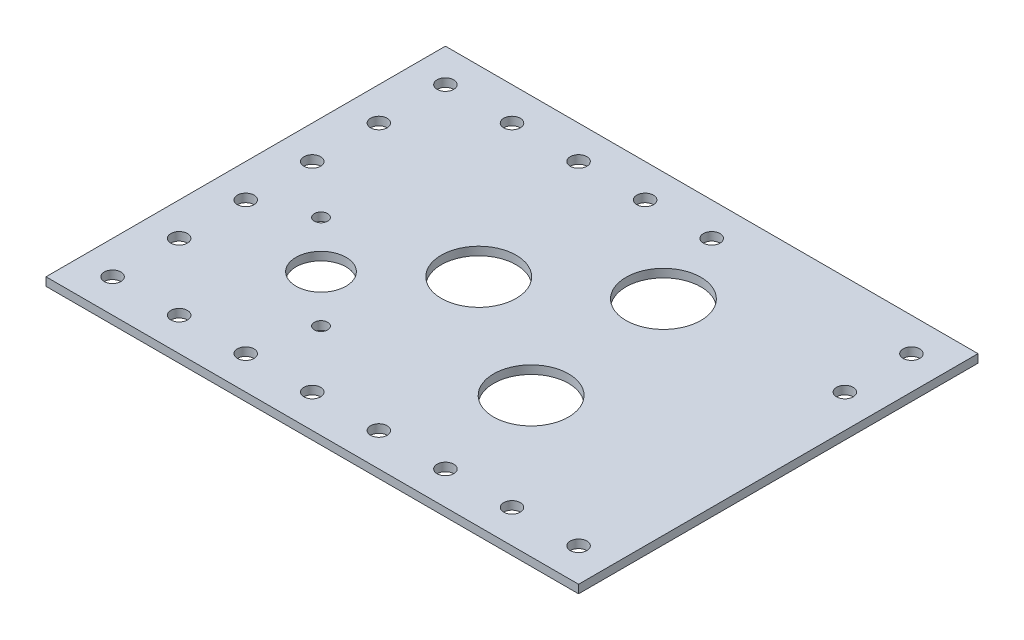
ISO-10303-21;
HEADER;
FILE_DESCRIPTION(('STEP AP214'),'2;1');
FILE_NAME('part.step','',(''),(''),'','','');
FILE_SCHEMA(('AUTOMOTIVE_DESIGN { 1 0 10303 214 1 1 1 1 }'));
ENDSEC;
DATA;
#1=APPLICATION_CONTEXT('core data for automotive mechanical design processes');
#2=APPLICATION_PROTOCOL_DEFINITION('international standard','automotive_design',2000,#1);
#3=PRODUCT_CONTEXT('',#1,'mechanical');
#4=PRODUCT('Part','Part','',(#3));
#5=PRODUCT_RELATED_PRODUCT_CATEGORY('part','',(#4));
#6=PRODUCT_DEFINITION_FORMATION('','',#4);
#7=PRODUCT_DEFINITION_CONTEXT('part definition',#1,'design');
#8=PRODUCT_DEFINITION('design','',#6,#7);
#9=PRODUCT_DEFINITION_SHAPE('','',#8);
#10=(LENGTH_UNIT() NAMED_UNIT(*) SI_UNIT(.MILLI.,.METRE.));
#11=(NAMED_UNIT(*) PLANE_ANGLE_UNIT() SI_UNIT($,.RADIAN.));
#12=(NAMED_UNIT(*) SI_UNIT($,.STERADIAN.) SOLID_ANGLE_UNIT());
#13=UNCERTAINTY_MEASURE_WITH_UNIT(LENGTH_MEASURE(1.E-05),#10,'distance_accuracy_value','');
#14=(GEOMETRIC_REPRESENTATION_CONTEXT(3) GLOBAL_UNCERTAINTY_ASSIGNED_CONTEXT((#13)) GLOBAL_UNIT_ASSIGNED_CONTEXT((#10,
#11,#12)) REPRESENTATION_CONTEXT('',''));
#15=CARTESIAN_POINT('',(0.,0.,0.));
#16=DIRECTION('',(0.,0.,1.));
#17=DIRECTION('',(1.,0.,0.));
#18=AXIS2_PLACEMENT_3D('',#15,#16,#17);
#19=CARTESIAN_POINT('',(0.,3.175,0.));
#20=DIRECTION('',(1.,0.,0.));
#21=DIRECTION('',(0.,0.,-1.));
#22=AXIS2_PLACEMENT_3D('',#19,#20,#21);
#23=PLANE('',#22);
#24=DIRECTION('',(0.,0.,1.));
#25=VECTOR('',#24,1.);
#26=CARTESIAN_POINT('',(0.,0.,0.));
#27=LINE('',#26,#25);
#28=CARTESIAN_POINT('',(0.,0.,-152.4));
#29=VERTEX_POINT('',#28);
#30=CARTESIAN_POINT('',(0.,0.,0.));
#31=VERTEX_POINT('',#30);
#32=EDGE_CURVE('E103',#29,#31,#27,.T.);
#33=ORIENTED_EDGE('',*,*,#32,.T.);
#34=DIRECTION('',(0.,-1.,0.));
#35=VECTOR('',#34,1.);
#36=CARTESIAN_POINT('',(0.,3.175,0.));
#37=LINE('',#36,#35);
#38=CARTESIAN_POINT('',(0.,3.175,0.));
#39=VERTEX_POINT('',#38);
#40=EDGE_CURVE('E11',#39,#31,#37,.T.);
#41=ORIENTED_EDGE('',*,*,#40,.F.);
#42=DIRECTION('',(0.,0.,1.));
#43=VECTOR('',#42,1.);
#44=CARTESIAN_POINT('',(0.,3.175,0.));
#45=LINE('',#44,#43);
#46=CARTESIAN_POINT('',(0.,3.175,-152.4));
#47=VERTEX_POINT('',#46);
#48=EDGE_CURVE('E90',#47,#39,#45,.T.);
#49=ORIENTED_EDGE('',*,*,#48,.F.);
#50=DIRECTION('',(0.,-1.,0.));
#51=VECTOR('',#50,1.);
#52=CARTESIAN_POINT('',(0.,3.175,-152.4));
#53=LINE('',#52,#51);
#54=EDGE_CURVE('E99',#47,#29,#53,.T.);
#55=ORIENTED_EDGE('',*,*,#54,.T.);
#56=EDGE_LOOP('',(#33,#41,#49,#55));
#57=FACE_BOUND('',#56,.T.);
#58=ADVANCED_FACE('F37',(#57),#23,.F.);
#59=CARTESIAN_POINT('',(0.,3.175,0.));
#60=DIRECTION('',(0.,0.,-1.));
#61=DIRECTION('',(-1.,0.,0.));
#62=AXIS2_PLACEMENT_3D('',#59,#60,#61);
#63=PLANE('',#62);
#64=DIRECTION('',(1.,0.,0.));
#65=VECTOR('',#64,1.);
#66=CARTESIAN_POINT('',(0.,0.,0.));
#67=LINE('',#66,#65);
#68=CARTESIAN_POINT('',(203.2,0.,0.));
#69=VERTEX_POINT('',#68);
#70=EDGE_CURVE('E94',#31,#69,#67,.T.);
#71=ORIENTED_EDGE('',*,*,#70,.T.);
#72=DIRECTION('',(0.,-1.,0.));
#73=VECTOR('',#72,1.);
#74=CARTESIAN_POINT('',(203.2,3.175,0.));
#75=LINE('',#74,#73);
#76=CARTESIAN_POINT('',(203.2,3.175,0.));
#77=VERTEX_POINT('',#76);
#78=EDGE_CURVE('E46',#77,#69,#75,.T.);
#79=ORIENTED_EDGE('',*,*,#78,.F.);
#80=DIRECTION('',(1.,0.,0.));
#81=VECTOR('',#80,1.);
#82=CARTESIAN_POINT('',(0.,3.175,0.));
#83=LINE('',#82,#81);
#84=EDGE_CURVE('E85',#39,#77,#83,.T.);
#85=ORIENTED_EDGE('',*,*,#84,.F.);
#86=ORIENTED_EDGE('',*,*,#40,.T.);
#87=EDGE_LOOP('',(#71,#79,#85,#86));
#88=FACE_BOUND('',#87,.T.);
#89=ADVANCED_FACE('F93',(#88),#63,.F.);
#90=CARTESIAN_POINT('',(203.2,3.175,0.));
#91=DIRECTION('',(-1.,0.,0.));
#92=DIRECTION('',(0.,0.,1.));
#93=AXIS2_PLACEMENT_3D('',#90,#91,#92);
#94=PLANE('',#93);
#95=DIRECTION('',(0.,0.,-1.));
#96=VECTOR('',#95,1.);
#97=CARTESIAN_POINT('',(203.2,0.,0.));
#98=LINE('',#97,#96);
#99=CARTESIAN_POINT('',(203.2,0.,-152.4));
#100=VERTEX_POINT('',#99);
#101=EDGE_CURVE('E72',#69,#100,#98,.T.);
#102=ORIENTED_EDGE('',*,*,#101,.T.);
#103=DIRECTION('',(0.,-1.,0.));
#104=VECTOR('',#103,1.);
#105=CARTESIAN_POINT('',(203.2,3.175,-152.4));
#106=LINE('',#105,#104);
#107=CARTESIAN_POINT('',(203.2,3.175,-152.4));
#108=VERTEX_POINT('',#107);
#109=EDGE_CURVE('E95',#108,#100,#106,.T.);
#110=ORIENTED_EDGE('',*,*,#109,.F.);
#111=DIRECTION('',(0.,0.,-1.));
#112=VECTOR('',#111,1.);
#113=CARTESIAN_POINT('',(203.2,3.175,0.));
#114=LINE('',#113,#112);
#115=EDGE_CURVE('E88',#77,#108,#114,.T.);
#116=ORIENTED_EDGE('',*,*,#115,.F.);
#117=ORIENTED_EDGE('',*,*,#78,.T.);
#118=EDGE_LOOP('',(#102,#110,#116,#117));
#119=FACE_BOUND('',#118,.T.);
#120=ADVANCED_FACE('F97',(#119),#94,.F.);
#121=CARTESIAN_POINT('',(0.,3.175,-152.4));
#122=DIRECTION('',(0.,0.,1.));
#123=DIRECTION('',(1.,0.,0.));
#124=AXIS2_PLACEMENT_3D('',#121,#122,#123);
#125=PLANE('',#124);
#126=DIRECTION('',(-1.,0.,0.));
#127=VECTOR('',#126,1.);
#128=CARTESIAN_POINT('',(0.,0.,-152.4));
#129=LINE('',#128,#127);
#130=EDGE_CURVE('E78',#100,#29,#129,.T.);
#131=ORIENTED_EDGE('',*,*,#130,.T.);
#132=ORIENTED_EDGE('',*,*,#54,.F.);
#133=DIRECTION('',(-1.,0.,0.));
#134=VECTOR('',#133,1.);
#135=CARTESIAN_POINT('',(0.,3.175,-152.4));
#136=LINE('',#135,#134);
#137=EDGE_CURVE('E55',#108,#47,#136,.T.);
#138=ORIENTED_EDGE('',*,*,#137,.F.);
#139=ORIENTED_EDGE('',*,*,#109,.T.);
#140=EDGE_LOOP('',(#131,#132,#138,#139));
#141=FACE_BOUND('',#140,.T.);
#142=ADVANCED_FACE('F266',(#141),#125,.F.);
#143=CARTESIAN_POINT('',(0.,3.175,0.));
#144=DIRECTION('',(0.,-1.,0.));
#145=DIRECTION('',(0.,0.,-1.));
#146=AXIS2_PLACEMENT_3D('',#143,#144,#145);
#147=PLANE('',#146);
#148=CARTESIAN_POINT('',(131.7498,3.175,-53.34));
#149=DIRECTION('',(0.,1.,0.));
#150=DIRECTION('',(0.,0.,1.));
#151=AXIS2_PLACEMENT_3D('',#148,#149,#150);
#152=CIRCLE('',#151,14.2875);
#153=CARTESIAN_POINT('',(131.7498,3.175,-39.0525));
#154=VERTEX_POINT('',#153);
#155=EDGE_CURVE('E214',#154,#154,#152,.T.);
#156=ORIENTED_EDGE('',*,*,#155,.F.);
#157=EDGE_LOOP('',(#156));
#158=FACE_BOUND('',#157,.T.);
#159=CARTESIAN_POINT('',(125.095,3.175,-110.49));
#160=DIRECTION('',(0.,1.,0.));
#161=DIRECTION('',(0.,0.,1.));
#162=AXIS2_PLACEMENT_3D('',#159,#160,#161);
#163=CIRCLE('',#162,14.2875);
#164=CARTESIAN_POINT('',(125.095,3.175,-96.2025));
#165=VERTEX_POINT('',#164);
#166=EDGE_CURVE('E204',#165,#165,#163,.T.);
#167=ORIENTED_EDGE('',*,*,#166,.F.);
#168=EDGE_LOOP('',(#167));
#169=FACE_BOUND('',#168,.T.);
#170=CARTESIAN_POINT('',(190.5,3.175,-139.7));
#171=DIRECTION('',(0.,1.,0.));
#172=DIRECTION('',(0.,0.,1.));
#173=AXIS2_PLACEMENT_3D('',#170,#171,#172);
#174=CIRCLE('',#173,3.175);
#175=CARTESIAN_POINT('',(190.5,3.175,-136.525));
#176=VERTEX_POINT('',#175);
#177=EDGE_CURVE('E201',#176,#176,#174,.T.);
#178=ORIENTED_EDGE('',*,*,#177,.F.);
#179=EDGE_LOOP('',(#178));
#180=FACE_BOUND('',#179,.T.);
#181=CARTESIAN_POINT('',(190.5,3.175,-114.3));
#182=DIRECTION('',(0.,1.,0.));
#183=DIRECTION('',(0.,0.,1.));
#184=AXIS2_PLACEMENT_3D('',#181,#182,#183);
#185=CIRCLE('',#184,3.175);
#186=CARTESIAN_POINT('',(190.5,3.175,-111.125));
#187=VERTEX_POINT('',#186);
#188=EDGE_CURVE('E198',#187,#187,#185,.T.);
#189=ORIENTED_EDGE('',*,*,#188,.F.);
#190=EDGE_LOOP('',(#189));
#191=FACE_BOUND('',#190,.T.);
#192=CARTESIAN_POINT('',(114.3,3.175,-139.7));
#193=DIRECTION('',(0.,1.,0.));
#194=DIRECTION('',(0.,0.,1.));
#195=AXIS2_PLACEMENT_3D('',#192,#193,#194);
#196=CIRCLE('',#195,3.175);
#197=CARTESIAN_POINT('',(114.3,3.175,-136.525));
#198=VERTEX_POINT('',#197);
#199=EDGE_CURVE('E194',#198,#198,#196,.T.);
#200=ORIENTED_EDGE('',*,*,#199,.F.);
#201=EDGE_LOOP('',(#200));
#202=FACE_BOUND('',#201,.T.);
#203=CARTESIAN_POINT('',(88.8999999999996,3.175,-139.7));
#204=DIRECTION('',(0.,1.,0.));
#205=DIRECTION('',(0.,0.,1.));
#206=AXIS2_PLACEMENT_3D('',#203,#204,#205);
#207=CIRCLE('',#206,3.175);
#208=CARTESIAN_POINT('',(88.8999999999996,3.175,-136.525));
#209=VERTEX_POINT('',#208);
#210=EDGE_CURVE('E190',#209,#209,#207,.T.);
#211=ORIENTED_EDGE('',*,*,#210,.F.);
#212=EDGE_LOOP('',(#211));
#213=FACE_BOUND('',#212,.T.);
#214=CARTESIAN_POINT('',(63.4999999999996,3.175,-139.7));
#215=DIRECTION('',(0.,1.,0.));
#216=DIRECTION('',(0.,0.,1.));
#217=AXIS2_PLACEMENT_3D('',#214,#215,#216);
#218=CIRCLE('',#217,3.175);
#219=CARTESIAN_POINT('',(63.4999999999996,3.175,-136.525));
#220=VERTEX_POINT('',#219);
#221=EDGE_CURVE('E186',#220,#220,#218,.T.);
#222=ORIENTED_EDGE('',*,*,#221,.F.);
#223=EDGE_LOOP('',(#222));
#224=FACE_BOUND('',#223,.T.);
#225=CARTESIAN_POINT('',(38.0999999999996,3.175,-139.7));
#226=DIRECTION('',(0.,1.,0.));
#227=DIRECTION('',(0.,0.,1.));
#228=AXIS2_PLACEMENT_3D('',#225,#226,#227);
#229=CIRCLE('',#228,3.175);
#230=CARTESIAN_POINT('',(38.0999999999996,3.175,-136.525));
#231=VERTEX_POINT('',#230);
#232=EDGE_CURVE('E182',#231,#231,#229,.T.);
#233=ORIENTED_EDGE('',*,*,#232,.F.);
#234=EDGE_LOOP('',(#233));
#235=FACE_BOUND('',#234,.T.);
#236=CARTESIAN_POINT('',(12.6999999999996,3.175,-139.7));
#237=DIRECTION('',(0.,1.,0.));
#238=DIRECTION('',(0.,0.,1.));
#239=AXIS2_PLACEMENT_3D('',#236,#237,#238);
#240=CIRCLE('',#239,3.175);
#241=CARTESIAN_POINT('',(12.6999999999996,3.175,-136.525));
#242=VERTEX_POINT('',#241);
#243=EDGE_CURVE('E178',#242,#242,#240,.T.);
#244=ORIENTED_EDGE('',*,*,#243,.F.);
#245=EDGE_LOOP('',(#244));
#246=FACE_BOUND('',#245,.T.);
#247=CARTESIAN_POINT('',(12.6999999999996,3.175,-114.3));
#248=DIRECTION('',(0.,1.,0.));
#249=DIRECTION('',(0.,0.,1.));
#250=AXIS2_PLACEMENT_3D('',#247,#248,#249);
#251=CIRCLE('',#250,3.175);
#252=CARTESIAN_POINT('',(12.6999999999996,3.175,-111.125));
#253=VERTEX_POINT('',#252);
#254=EDGE_CURVE('E174',#253,#253,#251,.T.);
#255=ORIENTED_EDGE('',*,*,#254,.F.);
#256=EDGE_LOOP('',(#255));
#257=FACE_BOUND('',#256,.T.);
#258=CARTESIAN_POINT('',(12.6999999999997,3.175,-88.9));
#259=DIRECTION('',(0.,1.,0.));
#260=DIRECTION('',(0.,0.,1.));
#261=AXIS2_PLACEMENT_3D('',#258,#259,#260);
#262=CIRCLE('',#261,3.175);
#263=CARTESIAN_POINT('',(12.6999999999997,3.175,-85.725));
#264=VERTEX_POINT('',#263);
#265=EDGE_CURVE('E170',#264,#264,#262,.T.);
#266=ORIENTED_EDGE('',*,*,#265,.F.);
#267=EDGE_LOOP('',(#266));
#268=FACE_BOUND('',#267,.T.);
#269=CARTESIAN_POINT('',(12.6999999999998,3.175,-63.5));
#270=DIRECTION('',(0.,1.,0.));
#271=DIRECTION('',(0.,0.,1.));
#272=AXIS2_PLACEMENT_3D('',#269,#270,#271);
#273=CIRCLE('',#272,3.175);
#274=CARTESIAN_POINT('',(12.6999999999998,3.175,-60.325));
#275=VERTEX_POINT('',#274);
#276=EDGE_CURVE('E166',#275,#275,#273,.T.);
#277=ORIENTED_EDGE('',*,*,#276,.F.);
#278=EDGE_LOOP('',(#277));
#279=FACE_BOUND('',#278,.T.);
#280=CARTESIAN_POINT('',(12.6999999999999,3.175,-38.1));
#281=DIRECTION('',(0.,1.,0.));
#282=DIRECTION('',(0.,0.,1.));
#283=AXIS2_PLACEMENT_3D('',#280,#281,#282);
#284=CIRCLE('',#283,3.175);
#285=CARTESIAN_POINT('',(12.6999999999999,3.175,-34.925));
#286=VERTEX_POINT('',#285);
#287=EDGE_CURVE('E162',#286,#286,#284,.T.);
#288=ORIENTED_EDGE('',*,*,#287,.F.);
#289=EDGE_LOOP('',(#288));
#290=FACE_BOUND('',#289,.T.);
#291=CARTESIAN_POINT('',(190.5,3.175,-12.7));
#292=DIRECTION('',(0.,1.,0.));
#293=DIRECTION('',(0.,0.,1.));
#294=AXIS2_PLACEMENT_3D('',#291,#292,#293);
#295=CIRCLE('',#294,3.175);
#296=CARTESIAN_POINT('',(190.5,3.175,-9.525));
#297=VERTEX_POINT('',#296);
#298=EDGE_CURVE('E158',#297,#297,#295,.T.);
#299=ORIENTED_EDGE('',*,*,#298,.F.);
#300=EDGE_LOOP('',(#299));
#301=FACE_BOUND('',#300,.T.);
#302=CARTESIAN_POINT('',(165.1,3.175,-12.7));
#303=DIRECTION('',(0.,1.,0.));
#304=DIRECTION('',(0.,0.,1.));
#305=AXIS2_PLACEMENT_3D('',#302,#303,#304);
#306=CIRCLE('',#305,3.17500000000002);
#307=CARTESIAN_POINT('',(165.1,3.175,-9.52499999999997));
#308=VERTEX_POINT('',#307);
#309=EDGE_CURVE('E154',#308,#308,#306,.T.);
#310=ORIENTED_EDGE('',*,*,#309,.F.);
#311=EDGE_LOOP('',(#310));
#312=FACE_BOUND('',#311,.T.);
#313=CARTESIAN_POINT('',(139.7,3.175,-12.7));
#314=DIRECTION('',(0.,1.,0.));
#315=DIRECTION('',(0.,0.,1.));
#316=AXIS2_PLACEMENT_3D('',#313,#314,#315);
#317=CIRCLE('',#316,3.17500000000002);
#318=CARTESIAN_POINT('',(139.7,3.175,-9.52499999999997));
#319=VERTEX_POINT('',#318);
#320=EDGE_CURVE('E150',#319,#319,#317,.T.);
#321=ORIENTED_EDGE('',*,*,#320,.F.);
#322=EDGE_LOOP('',(#321));
#323=FACE_BOUND('',#322,.T.);
#324=CARTESIAN_POINT('',(114.3,3.175,-12.7));
#325=DIRECTION('',(0.,1.,0.));
#326=DIRECTION('',(0.,0.,1.));
#327=AXIS2_PLACEMENT_3D('',#324,#325,#326);
#328=CIRCLE('',#327,3.175);
#329=CARTESIAN_POINT('',(114.3,3.175,-9.525));
#330=VERTEX_POINT('',#329);
#331=EDGE_CURVE('E146',#330,#330,#328,.T.);
#332=ORIENTED_EDGE('',*,*,#331,.F.);
#333=EDGE_LOOP('',(#332));
#334=FACE_BOUND('',#333,.T.);
#335=CARTESIAN_POINT('',(88.9,3.175,-12.7));
#336=DIRECTION('',(0.,1.,0.));
#337=DIRECTION('',(0.,0.,1.));
#338=AXIS2_PLACEMENT_3D('',#335,#336,#337);
#339=CIRCLE('',#338,3.175);
#340=CARTESIAN_POINT('',(88.9,3.175,-9.525));
#341=VERTEX_POINT('',#340);
#342=EDGE_CURVE('E142',#341,#341,#339,.T.);
#343=ORIENTED_EDGE('',*,*,#342,.F.);
#344=EDGE_LOOP('',(#343));
#345=FACE_BOUND('',#344,.T.);
#346=CARTESIAN_POINT('',(63.5,3.175,-12.7));
#347=DIRECTION('',(0.,1.,0.));
#348=DIRECTION('',(0.,0.,1.));
#349=AXIS2_PLACEMENT_3D('',#346,#347,#348);
#350=CIRCLE('',#349,3.175);
#351=CARTESIAN_POINT('',(63.5,3.175,-9.525));
#352=VERTEX_POINT('',#351);
#353=EDGE_CURVE('E138',#352,#352,#350,.T.);
#354=ORIENTED_EDGE('',*,*,#353,.F.);
#355=EDGE_LOOP('',(#354));
#356=FACE_BOUND('',#355,.T.);
#357=CARTESIAN_POINT('',(38.1,3.175,-12.7));
#358=DIRECTION('',(0.,1.,0.));
#359=DIRECTION('',(0.,0.,1.));
#360=AXIS2_PLACEMENT_3D('',#357,#358,#359);
#361=CIRCLE('',#360,3.175);
#362=CARTESIAN_POINT('',(38.1,3.175,-9.525));
#363=VERTEX_POINT('',#362);
#364=EDGE_CURVE('E134',#363,#363,#361,.T.);
#365=ORIENTED_EDGE('',*,*,#364,.F.);
#366=EDGE_LOOP('',(#365));
#367=FACE_BOUND('',#366,.T.);
#368=CARTESIAN_POINT('',(12.7,3.175,-12.7));
#369=DIRECTION('',(0.,1.,0.));
#370=DIRECTION('',(0.,0.,1.));
#371=AXIS2_PLACEMENT_3D('',#368,#369,#370);
#372=CIRCLE('',#371,3.175);
#373=CARTESIAN_POINT('',(12.7,3.175,-9.525));
#374=VERTEX_POINT('',#373);
#375=EDGE_CURVE('E130',#374,#374,#372,.T.);
#376=ORIENTED_EDGE('',*,*,#375,.F.);
#377=EDGE_LOOP('',(#376));
#378=FACE_BOUND('',#377,.T.);
#379=CARTESIAN_POINT('',(82.55,3.175,-82.55));
#380=DIRECTION('',(0.,1.,0.));
#381=DIRECTION('',(0.,0.,1.));
#382=AXIS2_PLACEMENT_3D('',#379,#380,#381);
#383=CIRCLE('',#382,14.29004);
#384=CARTESIAN_POINT('',(82.55,3.175,-68.25996));
#385=VERTEX_POINT('',#384);
#386=EDGE_CURVE('E126',#385,#385,#383,.T.);
#387=ORIENTED_EDGE('',*,*,#386,.F.);
#388=EDGE_LOOP('',(#387));
#389=FACE_BOUND('',#388,.T.);
#390=CARTESIAN_POINT('',(68.7578,3.175,-36.1696));
#391=DIRECTION('',(0.,1.,0.));
#392=DIRECTION('',(0.,0.,1.));
#393=AXIS2_PLACEMENT_3D('',#390,#391,#392);
#394=CIRCLE('',#393,2.54);
#395=CARTESIAN_POINT('',(68.7578,3.175,-33.6296));
#396=VERTEX_POINT('',#395);
#397=EDGE_CURVE('E122',#396,#396,#394,.T.);
#398=ORIENTED_EDGE('',*,*,#397,.F.);
#399=EDGE_LOOP('',(#398));
#400=FACE_BOUND('',#399,.T.);
#401=CARTESIAN_POINT('',(32.8422,3.175,-72.0852));
#402=DIRECTION('',(0.,1.,0.));
#403=DIRECTION('',(0.,0.,1.));
#404=AXIS2_PLACEMENT_3D('',#401,#402,#403);
#405=CIRCLE('',#404,2.54);
#406=CARTESIAN_POINT('',(32.8422,3.175,-69.5452));
#407=VERTEX_POINT('',#406);
#408=EDGE_CURVE('E118',#407,#407,#405,.T.);
#409=ORIENTED_EDGE('',*,*,#408,.F.);
#410=EDGE_LOOP('',(#409));
#411=FACE_BOUND('',#410,.T.);
#412=CARTESIAN_POINT('',(50.8,3.175,-54.1274));
#413=DIRECTION('',(0.,1.,0.));
#414=DIRECTION('',(0.,0.,1.));
#415=AXIS2_PLACEMENT_3D('',#412,#413,#414);
#416=CIRCLE('',#415,9.5504);
#417=CARTESIAN_POINT('',(50.8,3.175,-44.577));
#418=VERTEX_POINT('',#417);
#419=EDGE_CURVE('E114',#418,#418,#416,.T.);
#420=ORIENTED_EDGE('',*,*,#419,.F.);
#421=EDGE_LOOP('',(#420));
#422=FACE_BOUND('',#421,.T.);
#423=ORIENTED_EDGE('',*,*,#48,.T.);
#424=ORIENTED_EDGE('',*,*,#84,.T.);
#425=ORIENTED_EDGE('',*,*,#115,.T.);
#426=ORIENTED_EDGE('',*,*,#137,.T.);
#427=EDGE_LOOP('',(#423,#424,#425,#426));
#428=FACE_BOUND('',#427,.T.);
#429=ADVANCED_FACE('F86',(#158,#169,#180,#191,#202,#213,#224,#235,#246,#257,#268,#279,#290,#301,
#312,#323,#334,#345,#356,#367,#378,#389,#400,#411,#422,#428),#147,.F.);
#430=CARTESIAN_POINT('',(0.,0.,0.));
#431=DIRECTION('',(0.,-1.,0.));
#432=DIRECTION('',(0.,0.,-1.));
#433=AXIS2_PLACEMENT_3D('',#430,#431,#432);
#434=PLANE('',#433);
#435=CARTESIAN_POINT('',(131.7498,0.,-53.34));
#436=DIRECTION('',(0.,-1.,0.));
#437=DIRECTION('',(0.,0.,-1.));
#438=AXIS2_PLACEMENT_3D('',#435,#436,#437);
#439=CIRCLE('',#438,14.2875);
#440=CARTESIAN_POINT('',(131.7498,0.,-67.6275));
#441=VERTEX_POINT('',#440);
#442=EDGE_CURVE('E40',#441,#441,#439,.T.);
#443=ORIENTED_EDGE('',*,*,#442,.F.);
#444=EDGE_LOOP('',(#443));
#445=FACE_BOUND('',#444,.T.);
#446=CARTESIAN_POINT('',(125.095,0.,-110.49));
#447=DIRECTION('',(0.,-1.,0.));
#448=DIRECTION('',(0.,0.,-1.));
#449=AXIS2_PLACEMENT_3D('',#446,#447,#448);
#450=CIRCLE('',#449,14.2875);
#451=CARTESIAN_POINT('',(125.095,0.,-124.7775));
#452=VERTEX_POINT('',#451);
#453=EDGE_CURVE('E202',#452,#452,#450,.T.);
#454=ORIENTED_EDGE('',*,*,#453,.F.);
#455=EDGE_LOOP('',(#454));
#456=FACE_BOUND('',#455,.T.);
#457=CARTESIAN_POINT('',(190.5,0.,-139.7));
#458=DIRECTION('',(0.,-1.,0.));
#459=DIRECTION('',(0.,0.,-1.));
#460=AXIS2_PLACEMENT_3D('',#457,#458,#459);
#461=CIRCLE('',#460,3.175);
#462=CARTESIAN_POINT('',(190.5,0.,-142.875));
#463=VERTEX_POINT('',#462);
#464=EDGE_CURVE('E199',#463,#463,#461,.T.);
#465=ORIENTED_EDGE('',*,*,#464,.F.);
#466=EDGE_LOOP('',(#465));
#467=FACE_BOUND('',#466,.T.);
#468=CARTESIAN_POINT('',(190.5,0.,-114.3));
#469=DIRECTION('',(0.,-1.,0.));
#470=DIRECTION('',(0.,0.,-1.));
#471=AXIS2_PLACEMENT_3D('',#468,#469,#470);
#472=CIRCLE('',#471,3.175);
#473=CARTESIAN_POINT('',(190.5,0.,-117.475));
#474=VERTEX_POINT('',#473);
#475=EDGE_CURVE('E195',#474,#474,#472,.T.);
#476=ORIENTED_EDGE('',*,*,#475,.F.);
#477=EDGE_LOOP('',(#476));
#478=FACE_BOUND('',#477,.T.);
#479=CARTESIAN_POINT('',(114.3,0.,-139.7));
#480=DIRECTION('',(0.,-1.,0.));
#481=DIRECTION('',(0.,0.,-1.));
#482=AXIS2_PLACEMENT_3D('',#479,#480,#481);
#483=CIRCLE('',#482,3.175);
#484=CARTESIAN_POINT('',(114.3,0.,-142.875));
#485=VERTEX_POINT('',#484);
#486=EDGE_CURVE('E191',#485,#485,#483,.T.);
#487=ORIENTED_EDGE('',*,*,#486,.F.);
#488=EDGE_LOOP('',(#487));
#489=FACE_BOUND('',#488,.T.);
#490=CARTESIAN_POINT('',(88.8999999999996,0.,-139.7));
#491=DIRECTION('',(0.,-1.,0.));
#492=DIRECTION('',(0.,0.,-1.));
#493=AXIS2_PLACEMENT_3D('',#490,#491,#492);
#494=CIRCLE('',#493,3.175);
#495=CARTESIAN_POINT('',(88.8999999999996,0.,-142.875));
#496=VERTEX_POINT('',#495);
#497=EDGE_CURVE('E187',#496,#496,#494,.T.);
#498=ORIENTED_EDGE('',*,*,#497,.F.);
#499=EDGE_LOOP('',(#498));
#500=FACE_BOUND('',#499,.T.);
#501=CARTESIAN_POINT('',(63.4999999999996,0.,-139.7));
#502=DIRECTION('',(0.,-1.,0.));
#503=DIRECTION('',(0.,0.,-1.));
#504=AXIS2_PLACEMENT_3D('',#501,#502,#503);
#505=CIRCLE('',#504,3.175);
#506=CARTESIAN_POINT('',(63.4999999999996,0.,-142.875));
#507=VERTEX_POINT('',#506);
#508=EDGE_CURVE('E183',#507,#507,#505,.T.);
#509=ORIENTED_EDGE('',*,*,#508,.F.);
#510=EDGE_LOOP('',(#509));
#511=FACE_BOUND('',#510,.T.);
#512=CARTESIAN_POINT('',(38.0999999999996,0.,-139.7));
#513=DIRECTION('',(0.,-1.,0.));
#514=DIRECTION('',(0.,0.,-1.));
#515=AXIS2_PLACEMENT_3D('',#512,#513,#514);
#516=CIRCLE('',#515,3.175);
#517=CARTESIAN_POINT('',(38.0999999999996,0.,-142.875));
#518=VERTEX_POINT('',#517);
#519=EDGE_CURVE('E179',#518,#518,#516,.T.);
#520=ORIENTED_EDGE('',*,*,#519,.F.);
#521=EDGE_LOOP('',(#520));
#522=FACE_BOUND('',#521,.T.);
#523=CARTESIAN_POINT('',(12.6999999999996,0.,-139.7));
#524=DIRECTION('',(0.,-1.,0.));
#525=DIRECTION('',(0.,0.,-1.));
#526=AXIS2_PLACEMENT_3D('',#523,#524,#525);
#527=CIRCLE('',#526,3.175);
#528=CARTESIAN_POINT('',(12.6999999999996,0.,-142.875));
#529=VERTEX_POINT('',#528);
#530=EDGE_CURVE('E175',#529,#529,#527,.T.);
#531=ORIENTED_EDGE('',*,*,#530,.F.);
#532=EDGE_LOOP('',(#531));
#533=FACE_BOUND('',#532,.T.);
#534=CARTESIAN_POINT('',(12.6999999999996,0.,-114.3));
#535=DIRECTION('',(0.,-1.,0.));
#536=DIRECTION('',(0.,0.,-1.));
#537=AXIS2_PLACEMENT_3D('',#534,#535,#536);
#538=CIRCLE('',#537,3.175);
#539=CARTESIAN_POINT('',(12.6999999999996,0.,-117.475));
#540=VERTEX_POINT('',#539);
#541=EDGE_CURVE('E171',#540,#540,#538,.T.);
#542=ORIENTED_EDGE('',*,*,#541,.F.);
#543=EDGE_LOOP('',(#542));
#544=FACE_BOUND('',#543,.T.);
#545=CARTESIAN_POINT('',(12.6999999999997,0.,-88.9));
#546=DIRECTION('',(0.,-1.,0.));
#547=DIRECTION('',(0.,0.,-1.));
#548=AXIS2_PLACEMENT_3D('',#545,#546,#547);
#549=CIRCLE('',#548,3.175);
#550=CARTESIAN_POINT('',(12.6999999999997,0.,-92.075));
#551=VERTEX_POINT('',#550);
#552=EDGE_CURVE('E167',#551,#551,#549,.T.);
#553=ORIENTED_EDGE('',*,*,#552,.F.);
#554=EDGE_LOOP('',(#553));
#555=FACE_BOUND('',#554,.T.);
#556=CARTESIAN_POINT('',(12.6999999999998,0.,-63.5));
#557=DIRECTION('',(0.,-1.,0.));
#558=DIRECTION('',(0.,0.,-1.));
#559=AXIS2_PLACEMENT_3D('',#556,#557,#558);
#560=CIRCLE('',#559,3.175);
#561=CARTESIAN_POINT('',(12.6999999999998,0.,-66.675));
#562=VERTEX_POINT('',#561);
#563=EDGE_CURVE('E163',#562,#562,#560,.T.);
#564=ORIENTED_EDGE('',*,*,#563,.F.);
#565=EDGE_LOOP('',(#564));
#566=FACE_BOUND('',#565,.T.);
#567=CARTESIAN_POINT('',(12.6999999999999,0.,-38.1));
#568=DIRECTION('',(0.,-1.,0.));
#569=DIRECTION('',(0.,0.,-1.));
#570=AXIS2_PLACEMENT_3D('',#567,#568,#569);
#571=CIRCLE('',#570,3.175);
#572=CARTESIAN_POINT('',(12.6999999999999,0.,-41.275));
#573=VERTEX_POINT('',#572);
#574=EDGE_CURVE('E159',#573,#573,#571,.T.);
#575=ORIENTED_EDGE('',*,*,#574,.F.);
#576=EDGE_LOOP('',(#575));
#577=FACE_BOUND('',#576,.T.);
#578=CARTESIAN_POINT('',(190.5,0.,-12.7));
#579=DIRECTION('',(0.,-1.,0.));
#580=DIRECTION('',(0.,0.,-1.));
#581=AXIS2_PLACEMENT_3D('',#578,#579,#580);
#582=CIRCLE('',#581,3.175);
#583=CARTESIAN_POINT('',(190.5,0.,-15.875));
#584=VERTEX_POINT('',#583);
#585=EDGE_CURVE('E155',#584,#584,#582,.T.);
#586=ORIENTED_EDGE('',*,*,#585,.F.);
#587=EDGE_LOOP('',(#586));
#588=FACE_BOUND('',#587,.T.);
#589=CARTESIAN_POINT('',(165.1,0.,-12.7));
#590=DIRECTION('',(0.,-1.,0.));
#591=DIRECTION('',(0.,0.,-1.));
#592=AXIS2_PLACEMENT_3D('',#589,#590,#591);
#593=CIRCLE('',#592,3.17500000000002);
#594=CARTESIAN_POINT('',(165.1,0.,-15.875));
#595=VERTEX_POINT('',#594);
#596=EDGE_CURVE('E151',#595,#595,#593,.T.);
#597=ORIENTED_EDGE('',*,*,#596,.F.);
#598=EDGE_LOOP('',(#597));
#599=FACE_BOUND('',#598,.T.);
#600=CARTESIAN_POINT('',(139.7,0.,-12.7));
#601=DIRECTION('',(0.,-1.,0.));
#602=DIRECTION('',(0.,0.,-1.));
#603=AXIS2_PLACEMENT_3D('',#600,#601,#602);
#604=CIRCLE('',#603,3.17500000000002);
#605=CARTESIAN_POINT('',(139.7,0.,-15.875));
#606=VERTEX_POINT('',#605);
#607=EDGE_CURVE('E147',#606,#606,#604,.T.);
#608=ORIENTED_EDGE('',*,*,#607,.F.);
#609=EDGE_LOOP('',(#608));
#610=FACE_BOUND('',#609,.T.);
#611=CARTESIAN_POINT('',(114.3,0.,-12.7));
#612=DIRECTION('',(0.,-1.,0.));
#613=DIRECTION('',(0.,0.,-1.));
#614=AXIS2_PLACEMENT_3D('',#611,#612,#613);
#615=CIRCLE('',#614,3.175);
#616=CARTESIAN_POINT('',(114.3,0.,-15.875));
#617=VERTEX_POINT('',#616);
#618=EDGE_CURVE('E143',#617,#617,#615,.T.);
#619=ORIENTED_EDGE('',*,*,#618,.F.);
#620=EDGE_LOOP('',(#619));
#621=FACE_BOUND('',#620,.T.);
#622=CARTESIAN_POINT('',(88.9,0.,-12.7));
#623=DIRECTION('',(0.,-1.,0.));
#624=DIRECTION('',(0.,0.,-1.));
#625=AXIS2_PLACEMENT_3D('',#622,#623,#624);
#626=CIRCLE('',#625,3.175);
#627=CARTESIAN_POINT('',(88.9,0.,-15.875));
#628=VERTEX_POINT('',#627);
#629=EDGE_CURVE('E139',#628,#628,#626,.T.);
#630=ORIENTED_EDGE('',*,*,#629,.F.);
#631=EDGE_LOOP('',(#630));
#632=FACE_BOUND('',#631,.T.);
#633=CARTESIAN_POINT('',(63.5,0.,-12.7));
#634=DIRECTION('',(0.,-1.,0.));
#635=DIRECTION('',(0.,0.,-1.));
#636=AXIS2_PLACEMENT_3D('',#633,#634,#635);
#637=CIRCLE('',#636,3.175);
#638=CARTESIAN_POINT('',(63.5,0.,-15.875));
#639=VERTEX_POINT('',#638);
#640=EDGE_CURVE('E135',#639,#639,#637,.T.);
#641=ORIENTED_EDGE('',*,*,#640,.F.);
#642=EDGE_LOOP('',(#641));
#643=FACE_BOUND('',#642,.T.);
#644=CARTESIAN_POINT('',(38.1,0.,-12.7));
#645=DIRECTION('',(0.,-1.,0.));
#646=DIRECTION('',(0.,0.,-1.));
#647=AXIS2_PLACEMENT_3D('',#644,#645,#646);
#648=CIRCLE('',#647,3.175);
#649=CARTESIAN_POINT('',(38.1,0.,-15.875));
#650=VERTEX_POINT('',#649);
#651=EDGE_CURVE('E131',#650,#650,#648,.T.);
#652=ORIENTED_EDGE('',*,*,#651,.F.);
#653=EDGE_LOOP('',(#652));
#654=FACE_BOUND('',#653,.T.);
#655=CARTESIAN_POINT('',(12.7,0.,-12.7));
#656=DIRECTION('',(0.,-1.,0.));
#657=DIRECTION('',(0.,0.,-1.));
#658=AXIS2_PLACEMENT_3D('',#655,#656,#657);
#659=CIRCLE('',#658,3.175);
#660=CARTESIAN_POINT('',(12.7,0.,-15.875));
#661=VERTEX_POINT('',#660);
#662=EDGE_CURVE('E127',#661,#661,#659,.T.);
#663=ORIENTED_EDGE('',*,*,#662,.F.);
#664=EDGE_LOOP('',(#663));
#665=FACE_BOUND('',#664,.T.);
#666=CARTESIAN_POINT('',(82.55,0.,-82.55));
#667=DIRECTION('',(0.,-1.,0.));
#668=DIRECTION('',(0.,0.,-1.));
#669=AXIS2_PLACEMENT_3D('',#666,#667,#668);
#670=CIRCLE('',#669,14.29004);
#671=CARTESIAN_POINT('',(82.55,0.,-96.84004));
#672=VERTEX_POINT('',#671);
#673=EDGE_CURVE('E123',#672,#672,#670,.T.);
#674=ORIENTED_EDGE('',*,*,#673,.F.);
#675=EDGE_LOOP('',(#674));
#676=FACE_BOUND('',#675,.T.);
#677=CARTESIAN_POINT('',(68.7578,0.,-36.1696));
#678=DIRECTION('',(0.,-1.,0.));
#679=DIRECTION('',(0.,0.,-1.));
#680=AXIS2_PLACEMENT_3D('',#677,#678,#679);
#681=CIRCLE('',#680,2.54);
#682=CARTESIAN_POINT('',(68.7578,0.,-38.7096));
#683=VERTEX_POINT('',#682);
#684=EDGE_CURVE('E119',#683,#683,#681,.T.);
#685=ORIENTED_EDGE('',*,*,#684,.F.);
#686=EDGE_LOOP('',(#685));
#687=FACE_BOUND('',#686,.T.);
#688=CARTESIAN_POINT('',(32.8422,0.,-72.0852));
#689=DIRECTION('',(0.,-1.,0.));
#690=DIRECTION('',(0.,0.,-1.));
#691=AXIS2_PLACEMENT_3D('',#688,#689,#690);
#692=CIRCLE('',#691,2.54);
#693=CARTESIAN_POINT('',(32.8422,0.,-74.6252));
#694=VERTEX_POINT('',#693);
#695=EDGE_CURVE('E115',#694,#694,#692,.T.);
#696=ORIENTED_EDGE('',*,*,#695,.F.);
#697=EDGE_LOOP('',(#696));
#698=FACE_BOUND('',#697,.T.);
#699=CARTESIAN_POINT('',(50.8,0.,-54.1274));
#700=DIRECTION('',(0.,-1.,0.));
#701=DIRECTION('',(0.,0.,-1.));
#702=AXIS2_PLACEMENT_3D('',#699,#700,#701);
#703=CIRCLE('',#702,9.5504);
#704=CARTESIAN_POINT('',(50.8,0.,-63.6778));
#705=VERTEX_POINT('',#704);
#706=EDGE_CURVE('E106',#705,#705,#703,.T.);
#707=ORIENTED_EDGE('',*,*,#706,.F.);
#708=EDGE_LOOP('',(#707));
#709=FACE_BOUND('',#708,.T.);
#710=ORIENTED_EDGE('',*,*,#32,.F.);
#711=ORIENTED_EDGE('',*,*,#130,.F.);
#712=ORIENTED_EDGE('',*,*,#101,.F.);
#713=ORIENTED_EDGE('',*,*,#70,.F.);
#714=EDGE_LOOP('',(#710,#711,#712,#713));
#715=FACE_BOUND('',#714,.T.);
#716=ADVANCED_FACE('F265',(#445,#456,#467,#478,#489,#500,#511,#522,#533,#544,#555,#566,#577,
#588,#599,#610,#621,#632,#643,#654,#665,#676,#687,#698,#709,#715),#434,.T.);
#717=CARTESIAN_POINT('',(50.8,-1.5875,-54.1274));
#718=DIRECTION('',(0.,1.,0.));
#719=DIRECTION('',(0.,0.,1.));
#720=AXIS2_PLACEMENT_3D('',#717,#718,#719);
#721=CYLINDRICAL_SURFACE('',#720,9.5504);
#722=ORIENTED_EDGE('',*,*,#706,.T.);
#723=EDGE_LOOP('',(#722));
#724=FACE_BOUND('',#723,.T.);
#725=ORIENTED_EDGE('',*,*,#419,.T.);
#726=EDGE_LOOP('',(#725));
#727=FACE_BOUND('',#726,.T.);
#728=ADVANCED_FACE('F262',(#724,#727),#721,.F.);
#729=CARTESIAN_POINT('',(32.8422,-1.5875,-72.0852));
#730=DIRECTION('',(0.,1.,0.));
#731=DIRECTION('',(0.,0.,1.));
#732=AXIS2_PLACEMENT_3D('',#729,#730,#731);
#733=CYLINDRICAL_SURFACE('',#732,2.54);
#734=ORIENTED_EDGE('',*,*,#695,.T.);
#735=EDGE_LOOP('',(#734));
#736=FACE_BOUND('',#735,.T.);
#737=ORIENTED_EDGE('',*,*,#408,.T.);
#738=EDGE_LOOP('',(#737));
#739=FACE_BOUND('',#738,.T.);
#740=ADVANCED_FACE('F308',(#736,#739),#733,.F.);
#741=CARTESIAN_POINT('',(68.7578,-1.5875,-36.1696));
#742=DIRECTION('',(0.,1.,0.));
#743=DIRECTION('',(0.,0.,1.));
#744=AXIS2_PLACEMENT_3D('',#741,#742,#743);
#745=CYLINDRICAL_SURFACE('',#744,2.54);
#746=ORIENTED_EDGE('',*,*,#684,.T.);
#747=EDGE_LOOP('',(#746));
#748=FACE_BOUND('',#747,.T.);
#749=ORIENTED_EDGE('',*,*,#397,.T.);
#750=EDGE_LOOP('',(#749));
#751=FACE_BOUND('',#750,.T.);
#752=ADVANCED_FACE('F320',(#748,#751),#745,.F.);
#753=CARTESIAN_POINT('',(82.55,-1.5875,-82.55));
#754=DIRECTION('',(0.,1.,0.));
#755=DIRECTION('',(0.,0.,1.));
#756=AXIS2_PLACEMENT_3D('',#753,#754,#755);
#757=CYLINDRICAL_SURFACE('',#756,14.29004);
#758=ORIENTED_EDGE('',*,*,#673,.T.);
#759=EDGE_LOOP('',(#758));
#760=FACE_BOUND('',#759,.T.);
#761=ORIENTED_EDGE('',*,*,#386,.T.);
#762=EDGE_LOOP('',(#761));
#763=FACE_BOUND('',#762,.T.);
#764=ADVANCED_FACE('F331',(#760,#763),#757,.F.);
#765=CARTESIAN_POINT('',(12.7,-1.905,-12.7));
#766=DIRECTION('',(0.,1.,0.));
#767=DIRECTION('',(0.,0.,1.));
#768=AXIS2_PLACEMENT_3D('',#765,#766,#767);
#769=CYLINDRICAL_SURFACE('',#768,3.175);
#770=ORIENTED_EDGE('',*,*,#662,.T.);
#771=EDGE_LOOP('',(#770));
#772=FACE_BOUND('',#771,.T.);
#773=ORIENTED_EDGE('',*,*,#375,.T.);
#774=EDGE_LOOP('',(#773));
#775=FACE_BOUND('',#774,.T.);
#776=ADVANCED_FACE('F341',(#772,#775),#769,.F.);
#777=CARTESIAN_POINT('',(38.1,-1.905,-12.7));
#778=DIRECTION('',(0.,1.,0.));
#779=DIRECTION('',(0.,0.,1.));
#780=AXIS2_PLACEMENT_3D('',#777,#778,#779);
#781=CYLINDRICAL_SURFACE('',#780,3.175);
#782=ORIENTED_EDGE('',*,*,#651,.T.);
#783=EDGE_LOOP('',(#782));
#784=FACE_BOUND('',#783,.T.);
#785=ORIENTED_EDGE('',*,*,#364,.T.);
#786=EDGE_LOOP('',(#785));
#787=FACE_BOUND('',#786,.T.);
#788=ADVANCED_FACE('F353',(#784,#787),#781,.F.);
#789=CARTESIAN_POINT('',(63.5,-1.905,-12.7));
#790=DIRECTION('',(0.,1.,0.));
#791=DIRECTION('',(0.,0.,1.));
#792=AXIS2_PLACEMENT_3D('',#789,#790,#791);
#793=CYLINDRICAL_SURFACE('',#792,3.175);
#794=ORIENTED_EDGE('',*,*,#640,.T.);
#795=EDGE_LOOP('',(#794));
#796=FACE_BOUND('',#795,.T.);
#797=ORIENTED_EDGE('',*,*,#353,.T.);
#798=EDGE_LOOP('',(#797));
#799=FACE_BOUND('',#798,.T.);
#800=ADVANCED_FACE('F364',(#796,#799),#793,.F.);
#801=CARTESIAN_POINT('',(88.9,-1.905,-12.7));
#802=DIRECTION('',(0.,1.,0.));
#803=DIRECTION('',(0.,0.,1.));
#804=AXIS2_PLACEMENT_3D('',#801,#802,#803);
#805=CYLINDRICAL_SURFACE('',#804,3.175);
#806=ORIENTED_EDGE('',*,*,#629,.T.);
#807=EDGE_LOOP('',(#806));
#808=FACE_BOUND('',#807,.T.);
#809=ORIENTED_EDGE('',*,*,#342,.T.);
#810=EDGE_LOOP('',(#809));
#811=FACE_BOUND('',#810,.T.);
#812=ADVANCED_FACE('F375',(#808,#811),#805,.F.);
#813=CARTESIAN_POINT('',(114.3,-1.905,-12.7));
#814=DIRECTION('',(0.,1.,0.));
#815=DIRECTION('',(0.,0.,1.));
#816=AXIS2_PLACEMENT_3D('',#813,#814,#815);
#817=CYLINDRICAL_SURFACE('',#816,3.175);
#818=ORIENTED_EDGE('',*,*,#618,.T.);
#819=EDGE_LOOP('',(#818));
#820=FACE_BOUND('',#819,.T.);
#821=ORIENTED_EDGE('',*,*,#331,.T.);
#822=EDGE_LOOP('',(#821));
#823=FACE_BOUND('',#822,.T.);
#824=ADVANCED_FACE('F386',(#820,#823),#817,.F.);
#825=CARTESIAN_POINT('',(139.7,-1.905,-12.7));
#826=DIRECTION('',(0.,1.,0.));
#827=DIRECTION('',(0.,0.,1.));
#828=AXIS2_PLACEMENT_3D('',#825,#826,#827);
#829=CYLINDRICAL_SURFACE('',#828,3.17500000000002);
#830=ORIENTED_EDGE('',*,*,#607,.T.);
#831=EDGE_LOOP('',(#830));
#832=FACE_BOUND('',#831,.T.);
#833=ORIENTED_EDGE('',*,*,#320,.T.);
#834=EDGE_LOOP('',(#833));
#835=FACE_BOUND('',#834,.T.);
#836=ADVANCED_FACE('F397',(#832,#835),#829,.F.);
#837=CARTESIAN_POINT('',(165.1,-1.905,-12.7));
#838=DIRECTION('',(0.,1.,0.));
#839=DIRECTION('',(0.,0.,1.));
#840=AXIS2_PLACEMENT_3D('',#837,#838,#839);
#841=CYLINDRICAL_SURFACE('',#840,3.17500000000002);
#842=ORIENTED_EDGE('',*,*,#596,.T.);
#843=EDGE_LOOP('',(#842));
#844=FACE_BOUND('',#843,.T.);
#845=ORIENTED_EDGE('',*,*,#309,.T.);
#846=EDGE_LOOP('',(#845));
#847=FACE_BOUND('',#846,.T.);
#848=ADVANCED_FACE('F408',(#844,#847),#841,.F.);
#849=CARTESIAN_POINT('',(190.5,-1.905,-12.7));
#850=DIRECTION('',(0.,1.,0.));
#851=DIRECTION('',(0.,0.,1.));
#852=AXIS2_PLACEMENT_3D('',#849,#850,#851);
#853=CYLINDRICAL_SURFACE('',#852,3.175);
#854=ORIENTED_EDGE('',*,*,#585,.T.);
#855=EDGE_LOOP('',(#854));
#856=FACE_BOUND('',#855,.T.);
#857=ORIENTED_EDGE('',*,*,#298,.T.);
#858=EDGE_LOOP('',(#857));
#859=FACE_BOUND('',#858,.T.);
#860=ADVANCED_FACE('F419',(#856,#859),#853,.F.);
#861=CARTESIAN_POINT('',(12.6999999999999,-1.905,-38.1));
#862=DIRECTION('',(0.,1.,0.));
#863=DIRECTION('',(0.,0.,1.));
#864=AXIS2_PLACEMENT_3D('',#861,#862,#863);
#865=CYLINDRICAL_SURFACE('',#864,3.175);
#866=ORIENTED_EDGE('',*,*,#574,.T.);
#867=EDGE_LOOP('',(#866));
#868=FACE_BOUND('',#867,.T.);
#869=ORIENTED_EDGE('',*,*,#287,.T.);
#870=EDGE_LOOP('',(#869));
#871=FACE_BOUND('',#870,.T.);
#872=ADVANCED_FACE('F430',(#868,#871),#865,.F.);
#873=CARTESIAN_POINT('',(12.6999999999998,-1.905,-63.5));
#874=DIRECTION('',(0.,1.,0.));
#875=DIRECTION('',(0.,0.,1.));
#876=AXIS2_PLACEMENT_3D('',#873,#874,#875);
#877=CYLINDRICAL_SURFACE('',#876,3.175);
#878=ORIENTED_EDGE('',*,*,#563,.T.);
#879=EDGE_LOOP('',(#878));
#880=FACE_BOUND('',#879,.T.);
#881=ORIENTED_EDGE('',*,*,#276,.T.);
#882=EDGE_LOOP('',(#881));
#883=FACE_BOUND('',#882,.T.);
#884=ADVANCED_FACE('F441',(#880,#883),#877,.F.);
#885=CARTESIAN_POINT('',(12.6999999999997,-1.905,-88.9));
#886=DIRECTION('',(0.,1.,0.));
#887=DIRECTION('',(0.,0.,1.));
#888=AXIS2_PLACEMENT_3D('',#885,#886,#887);
#889=CYLINDRICAL_SURFACE('',#888,3.175);
#890=ORIENTED_EDGE('',*,*,#552,.T.);
#891=EDGE_LOOP('',(#890));
#892=FACE_BOUND('',#891,.T.);
#893=ORIENTED_EDGE('',*,*,#265,.T.);
#894=EDGE_LOOP('',(#893));
#895=FACE_BOUND('',#894,.T.);
#896=ADVANCED_FACE('F452',(#892,#895),#889,.F.);
#897=CARTESIAN_POINT('',(12.6999999999996,-1.905,-114.3));
#898=DIRECTION('',(0.,1.,0.));
#899=DIRECTION('',(0.,0.,1.));
#900=AXIS2_PLACEMENT_3D('',#897,#898,#899);
#901=CYLINDRICAL_SURFACE('',#900,3.175);
#902=ORIENTED_EDGE('',*,*,#541,.T.);
#903=EDGE_LOOP('',(#902));
#904=FACE_BOUND('',#903,.T.);
#905=ORIENTED_EDGE('',*,*,#254,.T.);
#906=EDGE_LOOP('',(#905));
#907=FACE_BOUND('',#906,.T.);
#908=ADVANCED_FACE('F463',(#904,#907),#901,.F.);
#909=CARTESIAN_POINT('',(12.6999999999996,-1.905,-139.7));
#910=DIRECTION('',(0.,1.,0.));
#911=DIRECTION('',(0.,0.,1.));
#912=AXIS2_PLACEMENT_3D('',#909,#910,#911);
#913=CYLINDRICAL_SURFACE('',#912,3.175);
#914=ORIENTED_EDGE('',*,*,#530,.T.);
#915=EDGE_LOOP('',(#914));
#916=FACE_BOUND('',#915,.T.);
#917=ORIENTED_EDGE('',*,*,#243,.T.);
#918=EDGE_LOOP('',(#917));
#919=FACE_BOUND('',#918,.T.);
#920=ADVANCED_FACE('F474',(#916,#919),#913,.F.);
#921=CARTESIAN_POINT('',(38.0999999999996,-1.905,-139.7));
#922=DIRECTION('',(0.,1.,0.));
#923=DIRECTION('',(0.,0.,1.));
#924=AXIS2_PLACEMENT_3D('',#921,#922,#923);
#925=CYLINDRICAL_SURFACE('',#924,3.175);
#926=ORIENTED_EDGE('',*,*,#519,.T.);
#927=EDGE_LOOP('',(#926));
#928=FACE_BOUND('',#927,.T.);
#929=ORIENTED_EDGE('',*,*,#232,.T.);
#930=EDGE_LOOP('',(#929));
#931=FACE_BOUND('',#930,.T.);
#932=ADVANCED_FACE('F485',(#928,#931),#925,.F.);
#933=CARTESIAN_POINT('',(63.4999999999996,-1.905,-139.7));
#934=DIRECTION('',(0.,1.,0.));
#935=DIRECTION('',(0.,0.,1.));
#936=AXIS2_PLACEMENT_3D('',#933,#934,#935);
#937=CYLINDRICAL_SURFACE('',#936,3.175);
#938=ORIENTED_EDGE('',*,*,#508,.T.);
#939=EDGE_LOOP('',(#938));
#940=FACE_BOUND('',#939,.T.);
#941=ORIENTED_EDGE('',*,*,#221,.T.);
#942=EDGE_LOOP('',(#941));
#943=FACE_BOUND('',#942,.T.);
#944=ADVANCED_FACE('F496',(#940,#943),#937,.F.);
#945=CARTESIAN_POINT('',(88.8999999999996,-1.905,-139.7));
#946=DIRECTION('',(0.,1.,0.));
#947=DIRECTION('',(0.,0.,1.));
#948=AXIS2_PLACEMENT_3D('',#945,#946,#947);
#949=CYLINDRICAL_SURFACE('',#948,3.175);
#950=ORIENTED_EDGE('',*,*,#497,.T.);
#951=EDGE_LOOP('',(#950));
#952=FACE_BOUND('',#951,.T.);
#953=ORIENTED_EDGE('',*,*,#210,.T.);
#954=EDGE_LOOP('',(#953));
#955=FACE_BOUND('',#954,.T.);
#956=ADVANCED_FACE('F507',(#952,#955),#949,.F.);
#957=CARTESIAN_POINT('',(114.3,-1.905,-139.7));
#958=DIRECTION('',(0.,1.,0.));
#959=DIRECTION('',(0.,0.,1.));
#960=AXIS2_PLACEMENT_3D('',#957,#958,#959);
#961=CYLINDRICAL_SURFACE('',#960,3.175);
#962=ORIENTED_EDGE('',*,*,#486,.T.);
#963=EDGE_LOOP('',(#962));
#964=FACE_BOUND('',#963,.T.);
#965=ORIENTED_EDGE('',*,*,#199,.T.);
#966=EDGE_LOOP('',(#965));
#967=FACE_BOUND('',#966,.T.);
#968=ADVANCED_FACE('F518',(#964,#967),#961,.F.);
#969=CARTESIAN_POINT('',(190.5,-1.905,-114.3));
#970=DIRECTION('',(0.,1.,0.));
#971=DIRECTION('',(0.,0.,1.));
#972=AXIS2_PLACEMENT_3D('',#969,#970,#971);
#973=CYLINDRICAL_SURFACE('',#972,3.175);
#974=ORIENTED_EDGE('',*,*,#475,.T.);
#975=EDGE_LOOP('',(#974));
#976=FACE_BOUND('',#975,.T.);
#977=ORIENTED_EDGE('',*,*,#188,.T.);
#978=EDGE_LOOP('',(#977));
#979=FACE_BOUND('',#978,.T.);
#980=ADVANCED_FACE('F529',(#976,#979),#973,.F.);
#981=CARTESIAN_POINT('',(190.5,-1.905,-139.7));
#982=DIRECTION('',(0.,1.,0.));
#983=DIRECTION('',(0.,0.,1.));
#984=AXIS2_PLACEMENT_3D('',#981,#982,#983);
#985=CYLINDRICAL_SURFACE('',#984,3.175);
#986=ORIENTED_EDGE('',*,*,#464,.T.);
#987=EDGE_LOOP('',(#986));
#988=FACE_BOUND('',#987,.T.);
#989=ORIENTED_EDGE('',*,*,#177,.T.);
#990=EDGE_LOOP('',(#989));
#991=FACE_BOUND('',#990,.T.);
#992=ADVANCED_FACE('F540',(#988,#991),#985,.F.);
#993=CARTESIAN_POINT('',(125.095,-22.225,-110.49));
#994=DIRECTION('',(0.,1.,0.));
#995=DIRECTION('',(0.,0.,1.));
#996=AXIS2_PLACEMENT_3D('',#993,#994,#995);
#997=CYLINDRICAL_SURFACE('',#996,14.2875);
#998=ORIENTED_EDGE('',*,*,#453,.T.);
#999=EDGE_LOOP('',(#998));
#1000=FACE_BOUND('',#999,.T.);
#1001=ORIENTED_EDGE('',*,*,#166,.T.);
#1002=EDGE_LOOP('',(#1001));
#1003=FACE_BOUND('',#1002,.T.);
#1004=ADVANCED_FACE('F549',(#1000,#1003),#997,.F.);
#1005=CARTESIAN_POINT('',(131.7498,-22.225,-53.34));
#1006=DIRECTION('',(0.,1.,0.));
#1007=DIRECTION('',(0.,0.,1.));
#1008=AXIS2_PLACEMENT_3D('',#1005,#1006,#1007);
#1009=CYLINDRICAL_SURFACE('',#1008,14.2875);
#1010=ORIENTED_EDGE('',*,*,#442,.T.);
#1011=EDGE_LOOP('',(#1010));
#1012=FACE_BOUND('',#1011,.T.);
#1013=ORIENTED_EDGE('',*,*,#155,.T.);
#1014=EDGE_LOOP('',(#1013));
#1015=FACE_BOUND('',#1014,.T.);
#1016=ADVANCED_FACE('F568',(#1012,#1015),#1009,.F.);
#1017=CLOSED_SHELL('',(#58,#89,#120,#142,#429,#716,#728,#740,#752,#764,#776,#788,#800,#812,#824,
#836,#848,#860,#872,#884,#896,#908,#920,#932,#944,#956,#968,#980,#992,#1004,#1016));
#1018=MANIFOLD_SOLID_BREP('B2',#1017);
#1019=ADVANCED_BREP_SHAPE_REPRESENTATION('',(#18,#1018),#14);
#1020=SHAPE_DEFINITION_REPRESENTATION(#9,#1019);
ENDSEC;
END-ISO-10303-21;
